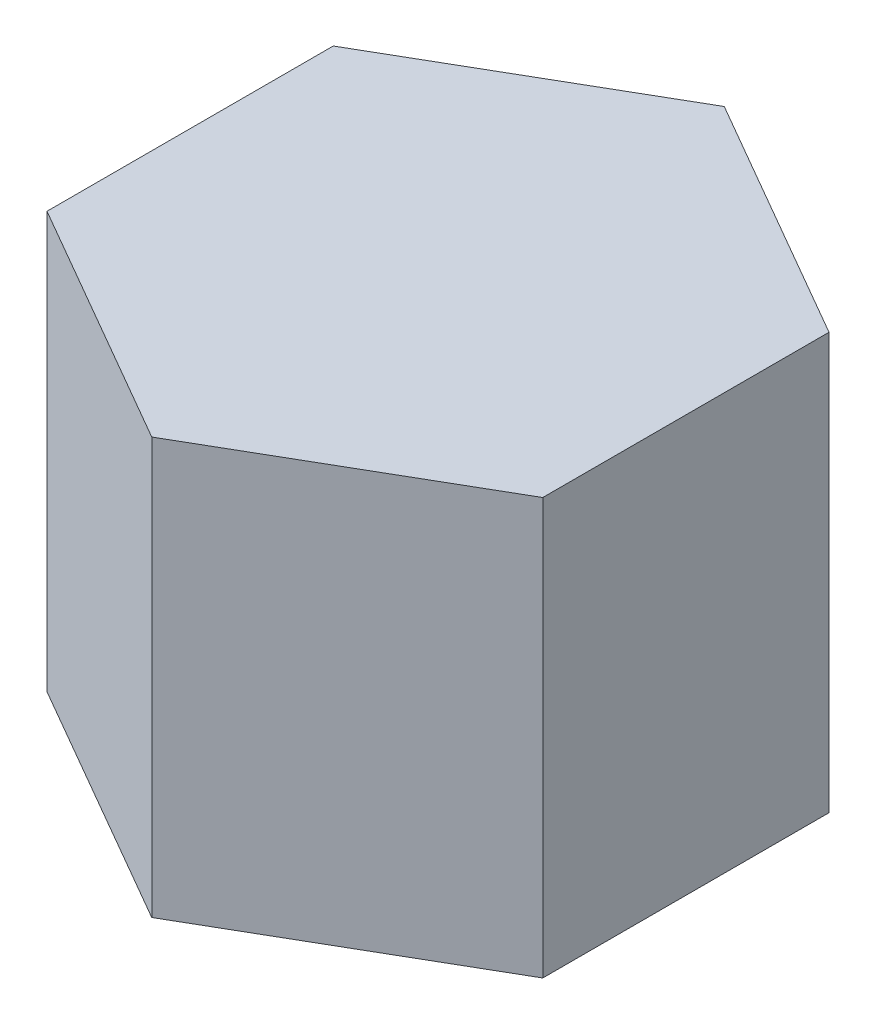
ISO-10303-21;
HEADER;
FILE_DESCRIPTION(('STEP AP214'),'2;1');
FILE_NAME('part.step','',(''),(''),'','','');
FILE_SCHEMA(('AUTOMOTIVE_DESIGN { 1 0 10303 214 1 1 1 1 }'));
ENDSEC;
DATA;
#1=APPLICATION_CONTEXT('core data for automotive mechanical design processes');
#2=APPLICATION_PROTOCOL_DEFINITION('international standard','automotive_design',2000,#1);
#3=PRODUCT_CONTEXT('',#1,'mechanical');
#4=PRODUCT('Part','Part','',(#3));
#5=PRODUCT_RELATED_PRODUCT_CATEGORY('part','',(#4));
#6=PRODUCT_DEFINITION_FORMATION('','',#4);
#7=PRODUCT_DEFINITION_CONTEXT('part definition',#1,'design');
#8=PRODUCT_DEFINITION('design','',#6,#7);
#9=PRODUCT_DEFINITION_SHAPE('','',#8);
#10=(LENGTH_UNIT() NAMED_UNIT(*) SI_UNIT(.MILLI.,.METRE.));
#11=(NAMED_UNIT(*) PLANE_ANGLE_UNIT() SI_UNIT($,.RADIAN.));
#12=(NAMED_UNIT(*) SI_UNIT($,.STERADIAN.) SOLID_ANGLE_UNIT());
#13=UNCERTAINTY_MEASURE_WITH_UNIT(LENGTH_MEASURE(1.E-05),#10,'distance_accuracy_value','');
#14=(GEOMETRIC_REPRESENTATION_CONTEXT(3) GLOBAL_UNCERTAINTY_ASSIGNED_CONTEXT((#13)) GLOBAL_UNIT_ASSIGNED_CONTEXT((#10,
#11,#12)) REPRESENTATION_CONTEXT('',''));
#15=CARTESIAN_POINT('',(0.,0.,0.));
#16=DIRECTION('',(0.,0.,1.));
#17=DIRECTION('',(1.,0.,0.));
#18=AXIS2_PLACEMENT_3D('',#15,#16,#17);
#19=CARTESIAN_POINT('',(201.839551417382,-147.556598747966,296.012098239417));
#20=DIRECTION('',(-0.500000000000096,0.,-0.866025403784383));
#21=DIRECTION('',(-0.866025403784383,0.,0.500000000000096));
#22=AXIS2_PLACEMENT_3D('',#19,#20,#21);
#23=PLANE('',#22);
#24=CARTESIAN_POINT('',(202.142660308706,-147.047793579175,295.837098239417));
#25=DIRECTION('',(-0.866025403784383,0.,0.500000000000096));
#26=VECTOR('',#25,1.);
#27=LINE('',#24,#26);
#28=CARTESIAN_POINT('',(202.142660308706,-147.047793579175,295.837098239417));
#29=VERTEX_POINT('',#28);
#30=CARTESIAN_POINT('',(201.839551417382,-147.047793579175,296.012098239417));
#31=VERTEX_POINT('',#30);
#32=EDGE_CURVE('E170',#29,#31,#27,.T.);
#33=ORIENTED_EDGE('',*,*,#32,.T.);
#34=CARTESIAN_POINT('',(201.839551417382,-147.556598747966,296.012098239417));
#35=DIRECTION('',(0.,1.,0.));
#36=VECTOR('',#35,1.);
#37=LINE('',#34,#36);
#38=CARTESIAN_POINT('',(201.839551417382,-147.556598747966,296.012098239417));
#39=VERTEX_POINT('',#38);
#40=EDGE_CURVE('E35',#39,#31,#37,.T.);
#41=ORIENTED_EDGE('',*,*,#40,.F.);
#42=CARTESIAN_POINT('',(202.142660308706,-147.556598747966,295.837098239417));
#43=DIRECTION('',(-0.866025403784383,0.,0.500000000000096));
#44=VECTOR('',#43,1.);
#45=LINE('',#42,#44);
#46=CARTESIAN_POINT('',(202.142660308706,-147.556598747966,295.837098239417));
#47=VERTEX_POINT('',#46);
#48=EDGE_CURVE('E159',#47,#39,#45,.T.);
#49=ORIENTED_EDGE('',*,*,#48,.F.);
#50=CARTESIAN_POINT('',(202.142660308706,-147.556598747966,295.837098239417));
#51=DIRECTION('',(0.,1.,0.));
#52=VECTOR('',#51,1.);
#53=LINE('',#50,#52);
#54=EDGE_CURVE('E10',#47,#29,#53,.T.);
#55=ORIENTED_EDGE('',*,*,#54,.T.);
#56=EDGE_LOOP('',(#33,#41,#49,#55));
#57=FACE_BOUND('',#56,.T.);
#58=ADVANCED_FACE('F16',(#57),#23,.F.);
#59=CARTESIAN_POINT('',(202.142660308706,-147.556598747966,291.594471220494));
#60=DIRECTION('',(-1.,0.,0.));
#61=DIRECTION('',(0.,-1.,0.));
#62=AXIS2_PLACEMENT_3D('',#59,#60,#61);
#63=PLANE('',#62);
#64=CARTESIAN_POINT('',(202.142660308706,-147.047793579175,295.487098239417));
#65=DIRECTION('',(0.,0.,1.));
#66=VECTOR('',#65,1.);
#67=LINE('',#64,#66);
#68=CARTESIAN_POINT('',(202.142660308706,-147.047793579175,295.487098239417));
#69=VERTEX_POINT('',#68);
#70=EDGE_CURVE('E167',#69,#29,#67,.T.);
#71=ORIENTED_EDGE('',*,*,#70,.T.);
#72=ORIENTED_EDGE('',*,*,#54,.F.);
#73=CARTESIAN_POINT('',(202.142660308706,-147.556598747966,295.487098239417));
#74=DIRECTION('',(0.,0.,1.));
#75=VECTOR('',#74,1.);
#76=LINE('',#73,#75);
#77=CARTESIAN_POINT('',(202.142660308706,-147.556598747966,295.487098239417));
#78=VERTEX_POINT('',#77);
#79=EDGE_CURVE('E156',#78,#47,#76,.T.);
#80=ORIENTED_EDGE('',*,*,#79,.F.);
#81=CARTESIAN_POINT('',(202.142660308706,-147.556598747966,295.487098239417));
#82=DIRECTION('',(0.,1.,0.));
#83=VECTOR('',#82,1.);
#84=LINE('',#81,#83);
#85=EDGE_CURVE('E27',#78,#69,#84,.T.);
#86=ORIENTED_EDGE('',*,*,#85,.T.);
#87=EDGE_LOOP('',(#71,#72,#80,#86));
#88=FACE_BOUND('',#87,.T.);
#89=ADVANCED_FACE('F189',(#88),#63,.F.);
#90=CARTESIAN_POINT('',(202.142660308706,-147.556598747966,295.487098239417));
#91=DIRECTION('',(-0.499999999999943,0.,0.866025403784471));
#92=DIRECTION('',(0.866025403784471,0.,0.499999999999943));
#93=AXIS2_PLACEMENT_3D('',#90,#91,#92);
#94=PLANE('',#93);
#95=CARTESIAN_POINT('',(201.839551417382,-147.047793579175,295.312098239417));
#96=DIRECTION('',(0.866025403784471,0.,0.499999999999943));
#97=VECTOR('',#96,1.);
#98=LINE('',#95,#97);
#99=CARTESIAN_POINT('',(201.839551417382,-147.047793579175,295.312098239417));
#100=VERTEX_POINT('',#99);
#101=EDGE_CURVE('E163',#100,#69,#98,.T.);
#102=ORIENTED_EDGE('',*,*,#101,.T.);
#103=ORIENTED_EDGE('',*,*,#85,.F.);
#104=CARTESIAN_POINT('',(201.839551417382,-147.556598747966,295.312098239417));
#105=DIRECTION('',(0.866025403784471,0.,0.499999999999943));
#106=VECTOR('',#105,1.);
#107=LINE('',#104,#106);
#108=CARTESIAN_POINT('',(201.839551417382,-147.556598747966,295.312098239417));
#109=VERTEX_POINT('',#108);
#110=EDGE_CURVE('E106',#109,#78,#107,.T.);
#111=ORIENTED_EDGE('',*,*,#110,.F.);
#112=CARTESIAN_POINT('',(201.839551417382,-147.556598747966,295.312098239417));
#113=DIRECTION('',(0.,1.,0.));
#114=VECTOR('',#113,1.);
#115=LINE('',#112,#114);
#116=EDGE_CURVE('E94',#109,#100,#115,.T.);
#117=ORIENTED_EDGE('',*,*,#116,.T.);
#118=EDGE_LOOP('',(#102,#103,#111,#117));
#119=FACE_BOUND('',#118,.T.);
#120=ADVANCED_FACE('F198',(#119),#94,.F.);
#121=CARTESIAN_POINT('',(201.839551417382,-147.556598747966,295.312098239417));
#122=DIRECTION('',(0.499999999999978,0.,0.866025403784452));
#123=DIRECTION('',(0.866025403784452,0.,-0.499999999999978));
#124=AXIS2_PLACEMENT_3D('',#121,#122,#123);
#125=PLANE('',#124);
#126=CARTESIAN_POINT('',(201.536442526057,-147.047793579175,295.487098239417));
#127=DIRECTION('',(0.866025403784452,0.,-0.499999999999978));
#128=VECTOR('',#127,1.);
#129=LINE('',#126,#128);
#130=CARTESIAN_POINT('',(201.536442526057,-147.047793579175,295.487098239417));
#131=VERTEX_POINT('',#130);
#132=EDGE_CURVE('E162',#131,#100,#129,.T.);
#133=ORIENTED_EDGE('',*,*,#132,.T.);
#134=ORIENTED_EDGE('',*,*,#116,.F.);
#135=CARTESIAN_POINT('',(201.536442526057,-147.556598747966,295.487098239417));
#136=DIRECTION('',(0.866025403784452,0.,-0.499999999999978));
#137=VECTOR('',#136,1.);
#138=LINE('',#135,#137);
#139=CARTESIAN_POINT('',(201.536442526057,-147.556598747966,295.487098239417));
#140=VERTEX_POINT('',#139);
#141=EDGE_CURVE('E98',#140,#109,#138,.T.);
#142=ORIENTED_EDGE('',*,*,#141,.F.);
#143=CARTESIAN_POINT('',(201.536442526057,-147.556598747966,295.487098239417));
#144=DIRECTION('',(0.,1.,0.));
#145=VECTOR('',#144,1.);
#146=LINE('',#143,#145);
#147=EDGE_CURVE('E79',#140,#131,#146,.T.);
#148=ORIENTED_EDGE('',*,*,#147,.T.);
#149=EDGE_LOOP('',(#133,#134,#142,#148));
#150=FACE_BOUND('',#149,.T.);
#151=ADVANCED_FACE('F100',(#150),#125,.F.);
#152=CARTESIAN_POINT('',(201.536442526057,-147.556598747966,291.594471220494));
#153=DIRECTION('',(1.,0.,0.));
#154=DIRECTION('',(0.,1.,0.));
#155=AXIS2_PLACEMENT_3D('',#152,#153,#154);
#156=PLANE('',#155);
#157=CARTESIAN_POINT('',(201.536442526057,-147.047793579175,295.837098239417));
#158=DIRECTION('',(0.,0.,-1.));
#159=VECTOR('',#158,1.);
#160=LINE('',#157,#159);
#161=CARTESIAN_POINT('',(201.536442526057,-147.047793579175,295.837098239417));
#162=VERTEX_POINT('',#161);
#163=EDGE_CURVE('E88',#162,#131,#160,.T.);
#164=ORIENTED_EDGE('',*,*,#163,.T.);
#165=ORIENTED_EDGE('',*,*,#147,.F.);
#166=CARTESIAN_POINT('',(201.536442526057,-147.556598747966,295.837098239417));
#167=DIRECTION('',(0.,0.,-1.));
#168=VECTOR('',#167,1.);
#169=LINE('',#166,#168);
#170=CARTESIAN_POINT('',(201.536442526057,-147.556598747966,295.837098239417));
#171=VERTEX_POINT('',#170);
#172=EDGE_CURVE('E84',#171,#140,#169,.T.);
#173=ORIENTED_EDGE('',*,*,#172,.F.);
#174=CARTESIAN_POINT('',(201.536442526057,-147.556598747966,295.837098239417));
#175=DIRECTION('',(0.,1.,0.));
#176=VECTOR('',#175,1.);
#177=LINE('',#174,#176);
#178=EDGE_CURVE('E58',#171,#162,#177,.T.);
#179=ORIENTED_EDGE('',*,*,#178,.T.);
#180=EDGE_LOOP('',(#164,#165,#173,#179));
#181=FACE_BOUND('',#180,.T.);
#182=ADVANCED_FACE('F82',(#181),#156,.F.);
#183=CARTESIAN_POINT('',(201.536442526057,-147.556598747966,295.837098239417));
#184=DIRECTION('',(0.499999999999978,0.,-0.866025403784452));
#185=DIRECTION('',(-0.866025403784452,0.,-0.499999999999978));
#186=AXIS2_PLACEMENT_3D('',#183,#184,#185);
#187=PLANE('',#186);
#188=CARTESIAN_POINT('',(201.839551417382,-147.047793579175,296.012098239417));
#189=DIRECTION('',(-0.866025403784452,0.,-0.499999999999978));
#190=VECTOR('',#189,1.);
#191=LINE('',#188,#190);
#192=EDGE_CURVE('E160',#31,#162,#191,.T.);
#193=ORIENTED_EDGE('',*,*,#192,.T.);
#194=ORIENTED_EDGE('',*,*,#178,.F.);
#195=CARTESIAN_POINT('',(201.839551417382,-147.556598747966,296.012098239417));
#196=DIRECTION('',(-0.866025403784452,0.,-0.499999999999978));
#197=VECTOR('',#196,1.);
#198=LINE('',#195,#197);
#199=EDGE_CURVE('E112',#39,#171,#198,.T.);
#200=ORIENTED_EDGE('',*,*,#199,.F.);
#201=ORIENTED_EDGE('',*,*,#40,.T.);
#202=EDGE_LOOP('',(#193,#194,#200,#201));
#203=FACE_BOUND('',#202,.T.);
#204=ADVANCED_FACE('F131',(#203),#187,.F.);
#205=CARTESIAN_POINT('',(206.491105863044,-147.556598747966,291.594471220494));
#206=DIRECTION('',(0.,1.,0.));
#207=DIRECTION('',(-1.,0.,0.));
#208=AXIS2_PLACEMENT_3D('',#205,#206,#207);
#209=PLANE('',#208);
#210=ORIENTED_EDGE('',*,*,#48,.T.);
#211=ORIENTED_EDGE('',*,*,#199,.T.);
#212=ORIENTED_EDGE('',*,*,#172,.T.);
#213=ORIENTED_EDGE('',*,*,#141,.T.);
#214=ORIENTED_EDGE('',*,*,#110,.T.);
#215=ORIENTED_EDGE('',*,*,#79,.T.);
#216=EDGE_LOOP('',(#210,#211,#212,#213,#214,#215));
#217=FACE_BOUND('',#216,.T.);
#218=ADVANCED_FACE('F111',(#217),#209,.F.);
#219=CARTESIAN_POINT('',(206.491105863044,-147.047793579175,291.594471220494));
#220=DIRECTION('',(0.,1.,0.));
#221=DIRECTION('',(-1.,0.,0.));
#222=AXIS2_PLACEMENT_3D('',#219,#220,#221);
#223=PLANE('',#222);
#224=ORIENTED_EDGE('',*,*,#32,.F.);
#225=ORIENTED_EDGE('',*,*,#70,.F.);
#226=ORIENTED_EDGE('',*,*,#101,.F.);
#227=ORIENTED_EDGE('',*,*,#132,.F.);
#228=ORIENTED_EDGE('',*,*,#163,.F.);
#229=ORIENTED_EDGE('',*,*,#192,.F.);
#230=EDGE_LOOP('',(#224,#225,#226,#227,#228,#229));
#231=FACE_BOUND('',#230,.T.);
#232=ADVANCED_FACE('F130',(#231),#223,.T.);
#233=CLOSED_SHELL('',(#58,#89,#120,#151,#182,#204,#218,#232));
#234=MANIFOLD_SOLID_BREP('B1',#233);
#235=ADVANCED_BREP_SHAPE_REPRESENTATION('',(#18,#234),#14);
#236=SHAPE_DEFINITION_REPRESENTATION(#9,#235);
ENDSEC;
END-ISO-10303-21;
